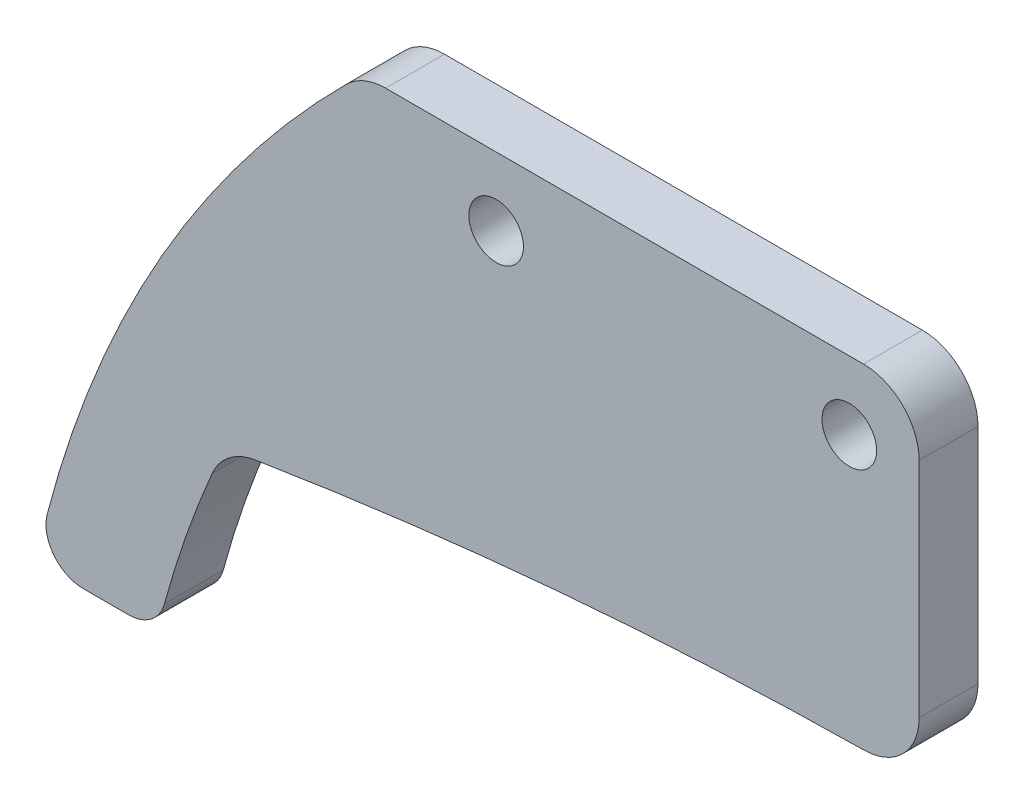
ISO-10303-21;
HEADER;
FILE_DESCRIPTION(('STEP AP214'),'2;1');
FILE_NAME('part.step','',(''),(''),'','','');
FILE_SCHEMA(('AUTOMOTIVE_DESIGN { 1 0 10303 214 1 1 1 1 }'));
ENDSEC;
DATA;
#1=APPLICATION_CONTEXT('core data for automotive mechanical design processes');
#2=APPLICATION_PROTOCOL_DEFINITION('international standard','automotive_design',2000,#1);
#3=PRODUCT_CONTEXT('',#1,'mechanical');
#4=PRODUCT('Part','Part','',(#3));
#5=PRODUCT_RELATED_PRODUCT_CATEGORY('part','',(#4));
#6=PRODUCT_DEFINITION_FORMATION('','',#4);
#7=PRODUCT_DEFINITION_CONTEXT('part definition',#1,'design');
#8=PRODUCT_DEFINITION('design','',#6,#7);
#9=PRODUCT_DEFINITION_SHAPE('','',#8);
#10=(LENGTH_UNIT() NAMED_UNIT(*) SI_UNIT(.MILLI.,.METRE.));
#11=(NAMED_UNIT(*) PLANE_ANGLE_UNIT() SI_UNIT($,.RADIAN.));
#12=(NAMED_UNIT(*) SI_UNIT($,.STERADIAN.) SOLID_ANGLE_UNIT());
#13=UNCERTAINTY_MEASURE_WITH_UNIT(LENGTH_MEASURE(1.E-05),#10,'distance_accuracy_value','');
#14=(GEOMETRIC_REPRESENTATION_CONTEXT(3) GLOBAL_UNCERTAINTY_ASSIGNED_CONTEXT((#13)) GLOBAL_UNIT_ASSIGNED_CONTEXT((#10,
#11,#12)) REPRESENTATION_CONTEXT('',''));
#15=CARTESIAN_POINT('',(0.,0.,0.));
#16=DIRECTION('',(0.,0.,1.));
#17=DIRECTION('',(1.,0.,0.));
#18=AXIS2_PLACEMENT_3D('',#15,#16,#17);
#19=CARTESIAN_POINT('',(-4.53525446655421,-2.24791019132198E-09,3.175));
#20=DIRECTION('',(0.,0.,-1.));
#21=DIRECTION('',(-1.,0.,0.));
#22=AXIS2_PLACEMENT_3D('',#19,#20,#21);
#23=CYLINDRICAL_SURFACE('',#22,55.2178372798589);
#24=CARTESIAN_POINT('',(-4.53525446655421,-2.24791019132198E-09,3.175));
#25=DIRECTION('',(0.,0.,1.));
#26=DIRECTION('',(1.,0.,0.));
#27=AXIS2_PLACEMENT_3D('',#24,#25,#26);
#28=CIRCLE('',#27,55.2178372798589);
#29=CARTESIAN_POINT('',(-55.2544336825675,21.8305843582061,3.175));
#30=VERTEX_POINT('',#29);
#31=CARTESIAN_POINT('',(-57.830873885165,14.4425241764258,3.175));
#32=VERTEX_POINT('',#31);
#33=EDGE_CURVE('E251',#30,#32,#28,.T.);
#34=ORIENTED_EDGE('',*,*,#33,.T.);
#35=DIRECTION('',(0.,0.,-1.));
#36=VECTOR('',#35,1.);
#37=CARTESIAN_POINT('',(-57.830873885165,14.4425241764258,3.175));
#38=LINE('',#37,#36);
#39=CARTESIAN_POINT('',(-57.830873885165,14.4425241764258,0.));
#40=VERTEX_POINT('',#39);
#41=EDGE_CURVE('E11',#32,#40,#38,.T.);
#42=ORIENTED_EDGE('',*,*,#41,.T.);
#43=CARTESIAN_POINT('',(-4.53525446655421,-2.24791019132198E-09,0.));
#44=DIRECTION('',(0.,0.,1.));
#45=DIRECTION('',(1.,0.,0.));
#46=AXIS2_PLACEMENT_3D('',#43,#44,#45);
#47=CIRCLE('',#46,55.2178372798589);
#48=CARTESIAN_POINT('',(-55.2544336825675,21.8305843582061,0.));
#49=VERTEX_POINT('',#48);
#50=EDGE_CURVE('E158',#49,#40,#47,.T.);
#51=ORIENTED_EDGE('',*,*,#50,.F.);
#52=DIRECTION('',(0.,0.,-1.));
#53=VECTOR('',#52,1.);
#54=CARTESIAN_POINT('',(-55.2544336825675,21.8305843582061,3.175));
#55=LINE('',#54,#53);
#56=EDGE_CURVE('E169',#49,#30,#55,.F.);
#57=ORIENTED_EDGE('',*,*,#56,.T.);
#58=EDGE_LOOP('',(#34,#42,#51,#57));
#59=FACE_BOUND('',#58,.T.);
#60=ADVANCED_FACE('F40',(#59),#23,.F.);
#61=CARTESIAN_POINT('',(-17.1227411890943,-197.062542023601,3.175));
#62=DIRECTION('',(0.,0.,-1.));
#63=DIRECTION('',(-1.,0.,0.));
#64=AXIS2_PLACEMENT_3D('',#61,#62,#63);
#65=CYLINDRICAL_SURFACE('',#64,223.562542023601);
#66=CARTESIAN_POINT('',(-17.1227411890943,-197.062542023601,3.175));
#67=DIRECTION('',(0.,0.,1.));
#68=DIRECTION('',(1.,0.,0.));
#69=AXIS2_PLACEMENT_3D('',#66,#67,#68);
#70=CIRCLE('',#69,223.562542023601);
#71=CARTESIAN_POINT('',(-20.0830170585314,26.4804000766388,3.175));
#72=VERTEX_POINT('',#71);
#73=CARTESIAN_POINT('',(-52.980018072984,23.6056838054169,3.175));
#74=VERTEX_POINT('',#73);
#75=EDGE_CURVE('E271',#72,#74,#70,.T.);
#76=ORIENTED_EDGE('',*,*,#75,.T.);
#77=DIRECTION('',(0.,0.,-1.));
#78=VECTOR('',#77,1.);
#79=CARTESIAN_POINT('',(-52.980018072984,23.6056838054169,3.175));
#80=LINE('',#79,#78);
#81=CARTESIAN_POINT('',(-52.980018072984,23.6056838054169,0.));
#82=VERTEX_POINT('',#81);
#83=EDGE_CURVE('E156',#74,#82,#80,.T.);
#84=ORIENTED_EDGE('',*,*,#83,.T.);
#85=CARTESIAN_POINT('',(-17.1227411890943,-197.062542023601,0.));
#86=DIRECTION('',(0.,0.,1.));
#87=DIRECTION('',(1.,0.,0.));
#88=AXIS2_PLACEMENT_3D('',#85,#86,#87);
#89=CIRCLE('',#88,223.562542023601);
#90=CARTESIAN_POINT('',(-20.0830170585314,26.4804000766388,0.));
#91=VERTEX_POINT('',#90);
#92=EDGE_CURVE('E138',#91,#82,#89,.T.);
#93=ORIENTED_EDGE('',*,*,#92,.F.);
#94=DIRECTION('',(0.,0.,-1.));
#95=VECTOR('',#94,1.);
#96=CARTESIAN_POINT('',(-20.0830170585314,26.4804000766389,3.175));
#97=LINE('',#96,#95);
#98=EDGE_CURVE('E153',#91,#72,#97,.F.);
#99=ORIENTED_EDGE('',*,*,#98,.T.);
#100=EDGE_LOOP('',(#76,#84,#93,#99));
#101=FACE_BOUND('',#100,.T.);
#102=ADVANCED_FACE('F152',(#101),#65,.F.);
#103=CARTESIAN_POINT('',(-17.1227411890943,0.,3.175));
#104=DIRECTION('',(-1.,0.,0.));
#105=DIRECTION('',(0.,0.,1.));
#106=AXIS2_PLACEMENT_3D('',#103,#104,#105);
#107=PLANE('',#106);
#108=DIRECTION('',(0.,1.,0.));
#109=VECTOR('',#108,1.);
#110=CARTESIAN_POINT('',(-17.1227411890943,0.,0.));
#111=LINE('',#110,#109);
#112=CARTESIAN_POINT('',(-17.1227411890943,29.4801370640181,0.));
#113=VERTEX_POINT('',#112);
#114=CARTESIAN_POINT('',(-17.1227411890943,41.5,0.));
#115=VERTEX_POINT('',#114);
#116=EDGE_CURVE('E140',#113,#115,#111,.T.);
#117=ORIENTED_EDGE('',*,*,#116,.T.);
#118=DIRECTION('',(0.,0.,-1.));
#119=VECTOR('',#118,1.);
#120=CARTESIAN_POINT('',(-17.1227411890943,41.5,3.175));
#121=LINE('',#120,#119);
#122=CARTESIAN_POINT('',(-17.1227411890943,41.5,3.175));
#123=VERTEX_POINT('',#122);
#124=EDGE_CURVE('E194',#115,#123,#121,.F.);
#125=ORIENTED_EDGE('',*,*,#124,.T.);
#126=DIRECTION('',(0.,1.,0.));
#127=VECTOR('',#126,1.);
#128=CARTESIAN_POINT('',(-17.1227411890943,0.,3.175));
#129=LINE('',#128,#127);
#130=CARTESIAN_POINT('',(-17.1227411890943,29.4801370640181,3.175));
#131=VERTEX_POINT('',#130);
#132=EDGE_CURVE('E267',#131,#123,#129,.T.);
#133=ORIENTED_EDGE('',*,*,#132,.F.);
#134=DIRECTION('',(0.,0.,1.));
#135=VECTOR('',#134,1.);
#136=CARTESIAN_POINT('',(-17.1227411890943,29.4801370640181,0.));
#137=LINE('',#136,#135);
#138=EDGE_CURVE('E191',#131,#113,#137,.F.);
#139=ORIENTED_EDGE('',*,*,#138,.T.);
#140=EDGE_LOOP('',(#117,#125,#133,#139));
#141=FACE_BOUND('',#140,.T.);
#142=ADVANCED_FACE('F322',(#141),#107,.F.);
#143=CARTESIAN_POINT('',(0.,44.5,3.175));
#144=DIRECTION('',(0.,-1.,0.));
#145=DIRECTION('',(1.,0.,0.));
#146=AXIS2_PLACEMENT_3D('',#143,#144,#145);
#147=PLANE('',#146);
#148=DIRECTION('',(-1.,0.,0.));
#149=VECTOR('',#148,1.);
#150=CARTESIAN_POINT('',(0.,44.5,3.175));
#151=LINE('',#150,#149);
#152=CARTESIAN_POINT('',(-20.1227411890942,44.5,3.175));
#153=VERTEX_POINT('',#152);
#154=CARTESIAN_POINT('',(-45.9009893848363,44.5,3.175));
#155=VERTEX_POINT('',#154);
#156=EDGE_CURVE('E263',#153,#155,#151,.T.);
#157=ORIENTED_EDGE('',*,*,#156,.F.);
#158=DIRECTION('',(0.,0.,-1.));
#159=VECTOR('',#158,1.);
#160=CARTESIAN_POINT('',(-20.1227411890942,44.5,3.175));
#161=LINE('',#160,#159);
#162=CARTESIAN_POINT('',(-20.1227411890942,44.5,0.));
#163=VERTEX_POINT('',#162);
#164=EDGE_CURVE('E147',#153,#163,#161,.T.);
#165=ORIENTED_EDGE('',*,*,#164,.T.);
#166=DIRECTION('',(-1.,0.,0.));
#167=VECTOR('',#166,1.);
#168=CARTESIAN_POINT('',(0.,44.5,0.));
#169=LINE('',#168,#167);
#170=CARTESIAN_POINT('',(-45.9009893848363,44.5,0.));
#171=VERTEX_POINT('',#170);
#172=EDGE_CURVE('E247',#163,#171,#169,.T.);
#173=ORIENTED_EDGE('',*,*,#172,.T.);
#174=DIRECTION('',(0.,0.,-1.));
#175=VECTOR('',#174,1.);
#176=CARTESIAN_POINT('',(-45.9009893848363,44.5,3.175));
#177=LINE('',#176,#175);
#178=EDGE_CURVE('E180',#171,#155,#177,.F.);
#179=ORIENTED_EDGE('',*,*,#178,.T.);
#180=EDGE_LOOP('',(#157,#165,#173,#179));
#181=FACE_BOUND('',#180,.T.);
#182=ADVANCED_FACE('F357',(#181),#147,.F.);
#183=CARTESIAN_POINT('',(-4.53525446655421,-2.24791019132198E-09,3.175));
#184=DIRECTION('',(0.,0.,-1.));
#185=DIRECTION('',(-1.,0.,0.));
#186=AXIS2_PLACEMENT_3D('',#183,#184,#185);
#187=CYLINDRICAL_SURFACE('',#186,61.5950000044045);
#188=CARTESIAN_POINT('',(-4.53525446655421,-2.24791019132198E-09,0.));
#189=DIRECTION('',(0.,0.,1.));
#190=DIRECTION('',(1.,0.,0.));
#191=AXIS2_PLACEMENT_3D('',#188,#189,#190);
#192=CIRCLE('',#191,61.5950000044045);
#193=CARTESIAN_POINT('',(-48.0188698310437,43.6247546718557,0.));
#194=VERTEX_POINT('',#193);
#195=CARTESIAN_POINT('',(-64.1564648245223,15.4678796518451,0.));
#196=VERTEX_POINT('',#195);
#197=EDGE_CURVE('E243',#194,#196,#192,.T.);
#198=ORIENTED_EDGE('',*,*,#197,.T.);
#199=DIRECTION('',(0.,0.,-1.));
#200=VECTOR('',#199,1.);
#201=CARTESIAN_POINT('',(-64.1564648245223,15.4678796518451,3.175));
#202=LINE('',#201,#200);
#203=CARTESIAN_POINT('',(-64.1564648245223,15.4678796518451,3.175));
#204=VERTEX_POINT('',#203);
#205=EDGE_CURVE('E64',#196,#204,#202,.F.);
#206=ORIENTED_EDGE('',*,*,#205,.T.);
#207=CARTESIAN_POINT('',(-4.53525446655421,-2.24791019132198E-09,3.175));
#208=DIRECTION('',(0.,0.,1.));
#209=DIRECTION('',(1.,0.,0.));
#210=AXIS2_PLACEMENT_3D('',#207,#208,#209);
#211=CIRCLE('',#210,61.5950000044045);
#212=CARTESIAN_POINT('',(-48.0188698310437,43.6247546718557,3.175));
#213=VERTEX_POINT('',#212);
#214=EDGE_CURVE('E172',#213,#204,#211,.T.);
#215=ORIENTED_EDGE('',*,*,#214,.F.);
#216=DIRECTION('',(0.,0.,-1.));
#217=VECTOR('',#216,1.);
#218=CARTESIAN_POINT('',(-48.0188698310437,43.6247546718557,3.175));
#219=LINE('',#218,#217);
#220=EDGE_CURVE('E205',#213,#194,#219,.T.);
#221=ORIENTED_EDGE('',*,*,#220,.T.);
#222=EDGE_LOOP('',(#198,#206,#215,#221));
#223=FACE_BOUND('',#222,.T.);
#224=ADVANCED_FACE('F244',(#223),#187,.T.);
#225=CARTESIAN_POINT('',(0.,12.9656350003965,3.175));
#226=DIRECTION('',(0.,-1.,0.));
#227=DIRECTION('',(0.,0.,-1.));
#228=AXIS2_PLACEMENT_3D('',#225,#226,#227);
#229=PLANE('',#228);
#230=DIRECTION('',(-1.,0.,0.));
#231=VECTOR('',#230,1.);
#232=CARTESIAN_POINT('',(0.,12.9656350003965,3.175));
#233=LINE('',#232,#231);
#234=CARTESIAN_POINT('',(-59.7612508084224,12.9656350003965,3.175));
#235=VERTEX_POINT('',#234);
#236=CARTESIAN_POINT('',(-62.2205541059995,12.9656350003965,3.175));
#237=VERTEX_POINT('',#236);
#238=EDGE_CURVE('E164',#235,#237,#233,.T.);
#239=ORIENTED_EDGE('',*,*,#238,.T.);
#240=DIRECTION('',(0.,0.,1.));
#241=VECTOR('',#240,1.);
#242=CARTESIAN_POINT('',(-62.2205541059995,12.9656350003965,0.));
#243=LINE('',#242,#241);
#244=CARTESIAN_POINT('',(-62.2205541059995,12.9656350003965,0.));
#245=VERTEX_POINT('',#244);
#246=EDGE_CURVE('E218',#237,#245,#243,.F.);
#247=ORIENTED_EDGE('',*,*,#246,.T.);
#248=DIRECTION('',(-1.,0.,0.));
#249=VECTOR('',#248,1.);
#250=CARTESIAN_POINT('',(0.,12.9656350003965,0.));
#251=LINE('',#250,#249);
#252=CARTESIAN_POINT('',(-59.7612508084224,12.9656350003965,0.));
#253=VERTEX_POINT('',#252);
#254=EDGE_CURVE('E175',#253,#245,#251,.T.);
#255=ORIENTED_EDGE('',*,*,#254,.F.);
#256=DIRECTION('',(0.,0.,-1.));
#257=VECTOR('',#256,1.);
#258=CARTESIAN_POINT('',(-59.7612508084224,12.9656350003965,3.175));
#259=LINE('',#258,#257);
#260=EDGE_CURVE('E215',#253,#235,#259,.F.);
#261=ORIENTED_EDGE('',*,*,#260,.T.);
#262=EDGE_LOOP('',(#239,#247,#255,#261));
#263=FACE_BOUND('',#262,.T.);
#264=ADVANCED_FACE('F238',(#263),#229,.T.);
#265=CARTESIAN_POINT('',(0.,0.,3.175));
#266=DIRECTION('',(0.,0.,1.));
#267=DIRECTION('',(1.,0.,0.));
#268=AXIS2_PLACEMENT_3D('',#265,#266,#267);
#269=PLANE('',#268);
#270=CARTESIAN_POINT('',(-20.8895656566918,40.8118922104986,3.175));
#271=DIRECTION('',(0.,0.,1.));
#272=DIRECTION('',(1.,0.,0.));
#273=AXIS2_PLACEMENT_3D('',#270,#271,#272);
#274=CIRCLE('',#273,1.4732);
#275=CARTESIAN_POINT('',(-19.4163656566918,40.8118922104986,3.175));
#276=VERTEX_POINT('',#275);
#277=EDGE_CURVE('E284',#276,#276,#274,.T.);
#278=ORIENTED_EDGE('',*,*,#277,.F.);
#279=EDGE_LOOP('',(#278));
#280=FACE_BOUND('',#279,.T.);
#281=CARTESIAN_POINT('',(-39.9395656566918,40.8118922104986,3.175));
#282=DIRECTION('',(0.,0.,1.));
#283=DIRECTION('',(1.,0.,0.));
#284=AXIS2_PLACEMENT_3D('',#281,#282,#283);
#285=CIRCLE('',#284,1.47320000000001);
#286=CARTESIAN_POINT('',(-38.4663656566918,40.8118922104986,3.175));
#287=VERTEX_POINT('',#286);
#288=EDGE_CURVE('E280',#287,#287,#285,.T.);
#289=ORIENTED_EDGE('',*,*,#288,.F.);
#290=EDGE_LOOP('',(#289));
#291=FACE_BOUND('',#290,.T.);
#292=ORIENTED_EDGE('',*,*,#214,.T.);
#293=CARTESIAN_POINT('',(-62.2205541059995,14.9656350003965,3.175));
#294=DIRECTION('',(0.,0.,1.));
#295=DIRECTION('',(1.,0.,0.));
#296=AXIS2_PLACEMENT_3D('',#293,#294,#295);
#297=CIRCLE('',#296,2.);
#298=EDGE_CURVE('E49',#204,#237,#297,.T.);
#299=ORIENTED_EDGE('',*,*,#298,.T.);
#300=ORIENTED_EDGE('',*,*,#238,.F.);
#301=CARTESIAN_POINT('',(-59.7612508084224,14.9656350003965,3.175));
#302=DIRECTION('',(0.,0.,1.));
#303=DIRECTION('',(1.,0.,0.));
#304=AXIS2_PLACEMENT_3D('',#301,#302,#303);
#305=CIRCLE('',#304,2.);
#306=EDGE_CURVE('E56',#235,#32,#305,.T.);
#307=ORIENTED_EDGE('',*,*,#306,.T.);
#308=ORIENTED_EDGE('',*,*,#33,.F.);
#309=CARTESIAN_POINT('',(-52.4988469891433,20.644522818899,3.175));
#310=DIRECTION('',(0.,0.,1.));
#311=DIRECTION('',(1.,0.,0.));
#312=AXIS2_PLACEMENT_3D('',#309,#310,#311);
#313=CIRCLE('',#312,3.);
#314=EDGE_CURVE('E212',#30,#74,#313,.F.);
#315=ORIENTED_EDGE('',*,*,#314,.T.);
#316=ORIENTED_EDGE('',*,*,#75,.F.);
#317=CARTESIAN_POINT('',(-20.1227411890942,29.4801370640181,3.175));
#318=DIRECTION('',(0.,0.,1.));
#319=DIRECTION('',(1.,0.,0.));
#320=AXIS2_PLACEMENT_3D('',#317,#318,#319);
#321=CIRCLE('',#320,3.);
#322=EDGE_CURVE('E162',#72,#131,#321,.T.);
#323=ORIENTED_EDGE('',*,*,#322,.T.);
#324=ORIENTED_EDGE('',*,*,#132,.T.);
#325=CARTESIAN_POINT('',(-20.1227411890942,41.5,3.175));
#326=DIRECTION('',(0.,0.,1.));
#327=DIRECTION('',(1.,0.,0.));
#328=AXIS2_PLACEMENT_3D('',#325,#326,#327);
#329=CIRCLE('',#328,3.);
#330=EDGE_CURVE('E202',#123,#153,#329,.T.);
#331=ORIENTED_EDGE('',*,*,#330,.T.);
#332=ORIENTED_EDGE('',*,*,#156,.T.);
#333=CARTESIAN_POINT('',(-45.9009893848363,41.5,3.175));
#334=DIRECTION('',(0.,0.,1.));
#335=DIRECTION('',(1.,0.,0.));
#336=AXIS2_PLACEMENT_3D('',#333,#334,#335);
#337=CIRCLE('',#336,3.);
#338=EDGE_CURVE('E199',#155,#213,#337,.T.);
#339=ORIENTED_EDGE('',*,*,#338,.T.);
#340=EDGE_LOOP('',(#292,#299,#300,#307,#308,#315,#316,#323,#324,#331,#332,#339));
#341=FACE_BOUND('',#340,.T.);
#342=ADVANCED_FACE('F234',(#280,#291,#341),#269,.T.);
#343=CARTESIAN_POINT('',(0.,0.,0.));
#344=DIRECTION('',(0.,0.,1.));
#345=DIRECTION('',(1.,0.,0.));
#346=AXIS2_PLACEMENT_3D('',#343,#344,#345);
#347=PLANE('',#346);
#348=CARTESIAN_POINT('',(-20.8895656566918,40.8118922104986,0.));
#349=DIRECTION('',(0.,0.,1.));
#350=DIRECTION('',(1.,0.,0.));
#351=AXIS2_PLACEMENT_3D('',#348,#349,#350);
#352=CIRCLE('',#351,1.4732);
#353=CARTESIAN_POINT('',(-19.4163656566918,40.8118922104986,0.));
#354=VERTEX_POINT('',#353);
#355=EDGE_CURVE('E259',#354,#354,#352,.T.);
#356=ORIENTED_EDGE('',*,*,#355,.T.);
#357=EDGE_LOOP('',(#356));
#358=FACE_BOUND('',#357,.T.);
#359=CARTESIAN_POINT('',(-39.9395656566918,40.8118922104986,0.));
#360=DIRECTION('',(0.,0.,1.));
#361=DIRECTION('',(1.,0.,0.));
#362=AXIS2_PLACEMENT_3D('',#359,#360,#361);
#363=CIRCLE('',#362,1.47320000000001);
#364=CARTESIAN_POINT('',(-38.4663656566918,40.8118922104986,0.));
#365=VERTEX_POINT('',#364);
#366=EDGE_CURVE('E276',#365,#365,#363,.T.);
#367=ORIENTED_EDGE('',*,*,#366,.T.);
#368=EDGE_LOOP('',(#367));
#369=FACE_BOUND('',#368,.T.);
#370=ORIENTED_EDGE('',*,*,#254,.T.);
#371=CARTESIAN_POINT('',(-62.2205541059995,14.9656350003965,0.));
#372=DIRECTION('',(0.,0.,1.));
#373=DIRECTION('',(1.,0.,0.));
#374=AXIS2_PLACEMENT_3D('',#371,#372,#373);
#375=CIRCLE('',#374,2.);
#376=EDGE_CURVE('E225',#245,#196,#375,.F.);
#377=ORIENTED_EDGE('',*,*,#376,.T.);
#378=ORIENTED_EDGE('',*,*,#197,.F.);
#379=CARTESIAN_POINT('',(-45.9009893848363,41.5,0.));
#380=DIRECTION('',(0.,0.,1.));
#381=DIRECTION('',(1.,0.,0.));
#382=AXIS2_PLACEMENT_3D('',#379,#380,#381);
#383=CIRCLE('',#382,3.);
#384=EDGE_CURVE('E146',#194,#171,#383,.F.);
#385=ORIENTED_EDGE('',*,*,#384,.T.);
#386=ORIENTED_EDGE('',*,*,#172,.F.);
#387=CARTESIAN_POINT('',(-20.1227411890942,41.5,0.));
#388=DIRECTION('',(0.,0.,1.));
#389=DIRECTION('',(1.,0.,0.));
#390=AXIS2_PLACEMENT_3D('',#387,#388,#389);
#391=CIRCLE('',#390,3.);
#392=EDGE_CURVE('E188',#163,#115,#391,.F.);
#393=ORIENTED_EDGE('',*,*,#392,.T.);
#394=ORIENTED_EDGE('',*,*,#116,.F.);
#395=CARTESIAN_POINT('',(-20.1227411890942,29.4801370640181,0.));
#396=DIRECTION('',(0.,0.,1.));
#397=DIRECTION('',(1.,0.,0.));
#398=AXIS2_PLACEMENT_3D('',#395,#396,#397);
#399=CIRCLE('',#398,3.);
#400=EDGE_CURVE('E134',#113,#91,#399,.F.);
#401=ORIENTED_EDGE('',*,*,#400,.T.);
#402=ORIENTED_EDGE('',*,*,#92,.T.);
#403=CARTESIAN_POINT('',(-52.4988469891433,20.644522818899,0.));
#404=DIRECTION('',(0.,0.,1.));
#405=DIRECTION('',(1.,0.,0.));
#406=AXIS2_PLACEMENT_3D('',#403,#404,#405);
#407=CIRCLE('',#406,3.);
#408=EDGE_CURVE('E209',#82,#49,#407,.T.);
#409=ORIENTED_EDGE('',*,*,#408,.T.);
#410=ORIENTED_EDGE('',*,*,#50,.T.);
#411=CARTESIAN_POINT('',(-59.7612508084224,14.9656350003965,0.));
#412=DIRECTION('',(0.,0.,1.));
#413=DIRECTION('',(1.,0.,0.));
#414=AXIS2_PLACEMENT_3D('',#411,#412,#413);
#415=CIRCLE('',#414,2.);
#416=EDGE_CURVE('E222',#40,#253,#415,.F.);
#417=ORIENTED_EDGE('',*,*,#416,.T.);
#418=EDGE_LOOP('',(#370,#377,#378,#385,#386,#393,#394,#401,#402,#409,#410,#417));
#419=FACE_BOUND('',#418,.T.);
#420=ADVANCED_FACE('F137',(#358,#369,#419),#347,.F.);
#421=CARTESIAN_POINT('',(-39.9395656566918,40.8118922104986,0.));
#422=DIRECTION('',(0.,0.,1.));
#423=DIRECTION('',(1.,0.,0.));
#424=AXIS2_PLACEMENT_3D('',#421,#422,#423);
#425=CYLINDRICAL_SURFACE('',#424,1.47320000000001);
#426=ORIENTED_EDGE('',*,*,#366,.F.);
#427=EDGE_LOOP('',(#426));
#428=FACE_BOUND('',#427,.T.);
#429=ORIENTED_EDGE('',*,*,#288,.T.);
#430=EDGE_LOOP('',(#429));
#431=FACE_BOUND('',#430,.T.);
#432=ADVANCED_FACE('F299',(#428,#431),#425,.F.);
#433=CARTESIAN_POINT('',(-20.8895656566918,40.8118922104986,0.));
#434=DIRECTION('',(0.,0.,1.));
#435=DIRECTION('',(1.,0.,0.));
#436=AXIS2_PLACEMENT_3D('',#433,#434,#435);
#437=CYLINDRICAL_SURFACE('',#436,1.4732);
#438=ORIENTED_EDGE('',*,*,#355,.F.);
#439=EDGE_LOOP('',(#438));
#440=FACE_BOUND('',#439,.T.);
#441=ORIENTED_EDGE('',*,*,#277,.T.);
#442=EDGE_LOOP('',(#441));
#443=FACE_BOUND('',#442,.T.);
#444=ADVANCED_FACE('F295',(#440,#443),#437,.F.);
#445=CARTESIAN_POINT('',(-52.4988469891433,20.644522818899,3.175));
#446=DIRECTION('',(0.,0.,1.));
#447=DIRECTION('',(1.,0.,0.));
#448=AXIS2_PLACEMENT_3D('',#445,#446,#447);
#449=CYLINDRICAL_SURFACE('',#448,3.);
#450=ORIENTED_EDGE('',*,*,#314,.F.);
#451=ORIENTED_EDGE('',*,*,#56,.F.);
#452=ORIENTED_EDGE('',*,*,#408,.F.);
#453=ORIENTED_EDGE('',*,*,#83,.F.);
#454=EDGE_LOOP('',(#450,#451,#452,#453));
#455=FACE_BOUND('',#454,.T.);
#456=ADVANCED_FACE('F298',(#455),#449,.F.);
#457=CARTESIAN_POINT('',(-20.1227411890942,41.5,3.175));
#458=DIRECTION('',(0.,0.,-1.));
#459=DIRECTION('',(-1.,0.,0.));
#460=AXIS2_PLACEMENT_3D('',#457,#458,#459);
#461=CYLINDRICAL_SURFACE('',#460,3.);
#462=ORIENTED_EDGE('',*,*,#330,.F.);
#463=ORIENTED_EDGE('',*,*,#124,.F.);
#464=ORIENTED_EDGE('',*,*,#392,.F.);
#465=ORIENTED_EDGE('',*,*,#164,.F.);
#466=EDGE_LOOP('',(#462,#463,#464,#465));
#467=FACE_BOUND('',#466,.T.);
#468=ADVANCED_FACE('F328',(#467),#461,.T.);
#469=CARTESIAN_POINT('',(-45.9009893848363,41.5,3.175));
#470=DIRECTION('',(0.,0.,-1.));
#471=DIRECTION('',(-1.,0.,0.));
#472=AXIS2_PLACEMENT_3D('',#469,#470,#471);
#473=CYLINDRICAL_SURFACE('',#472,3.);
#474=ORIENTED_EDGE('',*,*,#338,.F.);
#475=ORIENTED_EDGE('',*,*,#178,.F.);
#476=ORIENTED_EDGE('',*,*,#384,.F.);
#477=ORIENTED_EDGE('',*,*,#220,.F.);
#478=EDGE_LOOP('',(#474,#475,#476,#477));
#479=FACE_BOUND('',#478,.T.);
#480=ADVANCED_FACE('F332',(#479),#473,.T.);
#481=CARTESIAN_POINT('',(-20.1227411890942,29.4801370640181,3.175));
#482=DIRECTION('',(0.,0.,-1.));
#483=DIRECTION('',(-1.,0.,0.));
#484=AXIS2_PLACEMENT_3D('',#481,#482,#483);
#485=CYLINDRICAL_SURFACE('',#484,3.);
#486=ORIENTED_EDGE('',*,*,#322,.F.);
#487=ORIENTED_EDGE('',*,*,#98,.F.);
#488=ORIENTED_EDGE('',*,*,#400,.F.);
#489=ORIENTED_EDGE('',*,*,#138,.F.);
#490=EDGE_LOOP('',(#486,#487,#488,#489));
#491=FACE_BOUND('',#490,.T.);
#492=ADVANCED_FACE('F161',(#491),#485,.T.);
#493=CARTESIAN_POINT('',(-62.2205541059995,14.9656350003965,3.175));
#494=DIRECTION('',(0.,0.,-1.));
#495=DIRECTION('',(-1.,0.,0.));
#496=AXIS2_PLACEMENT_3D('',#493,#494,#495);
#497=CYLINDRICAL_SURFACE('',#496,2.);
#498=ORIENTED_EDGE('',*,*,#298,.F.);
#499=ORIENTED_EDGE('',*,*,#205,.F.);
#500=ORIENTED_EDGE('',*,*,#376,.F.);
#501=ORIENTED_EDGE('',*,*,#246,.F.);
#502=EDGE_LOOP('',(#498,#499,#500,#501));
#503=FACE_BOUND('',#502,.T.);
#504=ADVANCED_FACE('F241',(#503),#497,.T.);
#505=CARTESIAN_POINT('',(-59.7612508084224,14.9656350003965,3.175));
#506=DIRECTION('',(0.,0.,-1.));
#507=DIRECTION('',(-1.,0.,0.));
#508=AXIS2_PLACEMENT_3D('',#505,#506,#507);
#509=CYLINDRICAL_SURFACE('',#508,2.);
#510=ORIENTED_EDGE('',*,*,#306,.F.);
#511=ORIENTED_EDGE('',*,*,#260,.F.);
#512=ORIENTED_EDGE('',*,*,#416,.F.);
#513=ORIENTED_EDGE('',*,*,#41,.F.);
#514=EDGE_LOOP('',(#510,#511,#512,#513));
#515=FACE_BOUND('',#514,.T.);
#516=ADVANCED_FACE('F42',(#515),#509,.T.);
#517=CLOSED_SHELL('',(#60,#102,#142,#182,#224,#264,#342,#420,#432,#444,#456,#468,#480,#492,#504,#516));
#518=MANIFOLD_SOLID_BREP('B2',#517);
#519=ADVANCED_BREP_SHAPE_REPRESENTATION('',(#18,#518),#14);
#520=SHAPE_DEFINITION_REPRESENTATION(#9,#519);
ENDSEC;
END-ISO-10303-21;
